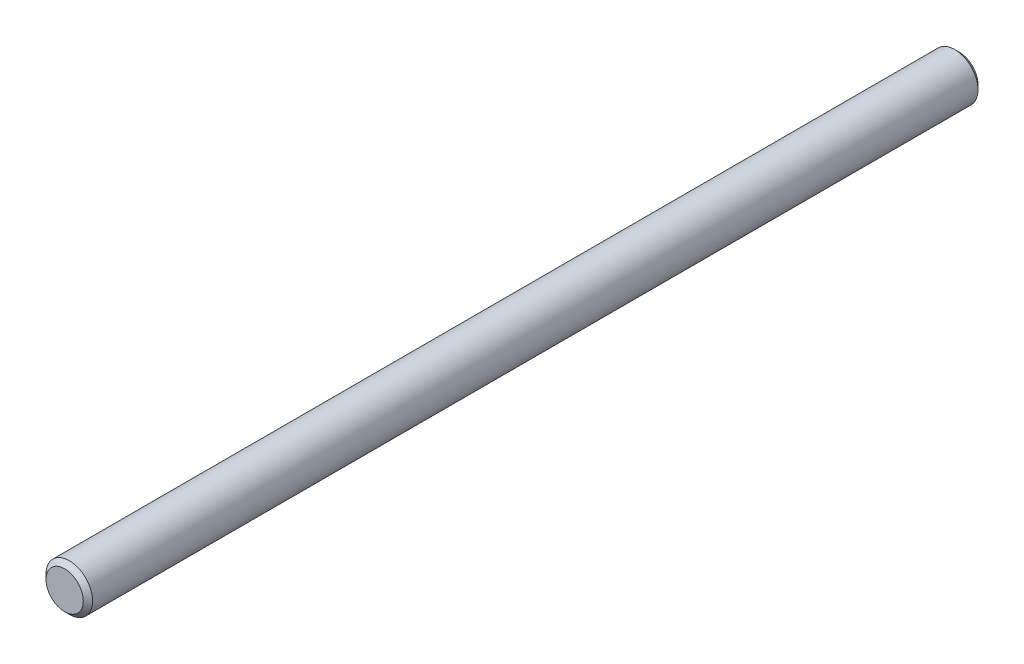
ISO-10303-21;
HEADER;
FILE_DESCRIPTION(('STEP AP214'),'2;1');
FILE_NAME('part.step','',(''),(''),'','','');
FILE_SCHEMA(('AUTOMOTIVE_DESIGN { 1 0 10303 214 1 1 1 1 }'));
ENDSEC;
DATA;
#1=APPLICATION_CONTEXT('core data for automotive mechanical design processes');
#2=APPLICATION_PROTOCOL_DEFINITION('international standard','automotive_design',2000,#1);
#3=PRODUCT_CONTEXT('',#1,'mechanical');
#4=PRODUCT('Part','Part','',(#3));
#5=PRODUCT_RELATED_PRODUCT_CATEGORY('part','',(#4));
#6=PRODUCT_DEFINITION_FORMATION('','',#4);
#7=PRODUCT_DEFINITION_CONTEXT('part definition',#1,'design');
#8=PRODUCT_DEFINITION('design','',#6,#7);
#9=PRODUCT_DEFINITION_SHAPE('','',#8);
#10=(LENGTH_UNIT() NAMED_UNIT(*) SI_UNIT(.MILLI.,.METRE.));
#11=(NAMED_UNIT(*) PLANE_ANGLE_UNIT() SI_UNIT($,.RADIAN.));
#12=(NAMED_UNIT(*) SI_UNIT($,.STERADIAN.) SOLID_ANGLE_UNIT());
#13=UNCERTAINTY_MEASURE_WITH_UNIT(LENGTH_MEASURE(1.E-05),#10,'distance_accuracy_value','');
#14=(GEOMETRIC_REPRESENTATION_CONTEXT(3) GLOBAL_UNCERTAINTY_ASSIGNED_CONTEXT((#13)) GLOBAL_UNIT_ASSIGNED_CONTEXT((#10,
#11,#12)) REPRESENTATION_CONTEXT('',''));
#15=CARTESIAN_POINT('',(0.,0.,0.));
#16=DIRECTION('',(0.,0.,1.));
#17=DIRECTION('',(1.,0.,0.));
#18=AXIS2_PLACEMENT_3D('',#15,#16,#17);
#19=CARTESIAN_POINT('',(0.,0.,76.2));
#20=DIRECTION('',(0.,0.,-1.));
#21=DIRECTION('',(-1.,0.,0.));
#22=AXIS2_PLACEMENT_3D('',#19,#20,#21);
#23=CYLINDRICAL_SURFACE('',#22,3.96875);
#24=CARTESIAN_POINT('',(0.,0.,-75.4062499999998));
#25=DIRECTION('',(0.,0.,1.));
#26=DIRECTION('',(1.,0.,0.));
#27=AXIS2_PLACEMENT_3D('',#24,#25,#26);
#28=CIRCLE('',#27,3.96875);
#29=CARTESIAN_POINT('',(3.96875,0.,-75.4062499999998));
#30=VERTEX_POINT('',#29);
#31=EDGE_CURVE('E48',#30,#30,#28,.T.);
#32=ORIENTED_EDGE('',*,*,#31,.T.);
#33=EDGE_LOOP('',(#32));
#34=FACE_BOUND('',#33,.T.);
#35=CARTESIAN_POINT('',(0.,0.,75.4062500000001));
#36=DIRECTION('',(0.,0.,1.));
#37=DIRECTION('',(1.,0.,0.));
#38=AXIS2_PLACEMENT_3D('',#35,#36,#37);
#39=CIRCLE('',#38,3.96875);
#40=CARTESIAN_POINT('',(3.96875,0.,75.4062500000001));
#41=VERTEX_POINT('',#40);
#42=EDGE_CURVE('E53',#41,#41,#39,.F.);
#43=ORIENTED_EDGE('',*,*,#42,.T.);
#44=EDGE_LOOP('',(#43));
#45=FACE_BOUND('',#44,.T.);
#46=ADVANCED_FACE('F34',(#34,#45),#23,.T.);
#47=CARTESIAN_POINT('',(0.,0.,76.2));
#48=DIRECTION('',(0.,0.,1.));
#49=DIRECTION('',(1.,0.,0.));
#50=AXIS2_PLACEMENT_3D('',#47,#48,#49);
#51=PLANE('',#50);
#52=CARTESIAN_POINT('',(0.,0.,76.2));
#53=DIRECTION('',(0.,0.,1.));
#54=DIRECTION('',(1.,0.,0.));
#55=AXIS2_PLACEMENT_3D('',#52,#53,#54);
#56=CIRCLE('',#55,3.17500000000007);
#57=CARTESIAN_POINT('',(3.17500000000007,0.,76.2));
#58=VERTEX_POINT('',#57);
#59=EDGE_CURVE('E10',#58,#58,#56,.T.);
#60=ORIENTED_EDGE('',*,*,#59,.T.);
#61=EDGE_LOOP('',(#60));
#62=FACE_BOUND('',#61,.T.);
#63=ADVANCED_FACE('F69',(#62),#51,.T.);
#64=CARTESIAN_POINT('',(0.,0.,-76.2));
#65=DIRECTION('',(0.,0.,1.));
#66=DIRECTION('',(1.,0.,0.));
#67=AXIS2_PLACEMENT_3D('',#64,#65,#66);
#68=PLANE('',#67);
#69=CARTESIAN_POINT('',(0.,0.,-76.2));
#70=DIRECTION('',(0.,0.,1.));
#71=DIRECTION('',(1.,0.,0.));
#72=AXIS2_PLACEMENT_3D('',#69,#70,#71);
#73=CIRCLE('',#72,3.17499999999982);
#74=CARTESIAN_POINT('',(3.17499999999982,0.,-76.2));
#75=VERTEX_POINT('',#74);
#76=EDGE_CURVE('E42',#75,#75,#73,.F.);
#77=ORIENTED_EDGE('',*,*,#76,.T.);
#78=EDGE_LOOP('',(#77));
#79=FACE_BOUND('',#78,.T.);
#80=ADVANCED_FACE('F66',(#79),#68,.F.);
#81=CARTESIAN_POINT('',(0.,0.,-75.4062499999998));
#82=DIRECTION('',(0.,0.,1.));
#83=DIRECTION('',(1.,0.,0.));
#84=AXIS2_PLACEMENT_3D('',#81,#82,#83);
#85=CONICAL_SURFACE('',#84,3.96875,0.785398163397453);
#86=ORIENTED_EDGE('',*,*,#76,.F.);
#87=EDGE_LOOP('',(#86));
#88=FACE_BOUND('',#87,.T.);
#89=ORIENTED_EDGE('',*,*,#31,.F.);
#90=EDGE_LOOP('',(#89));
#91=FACE_BOUND('',#90,.T.);
#92=ADVANCED_FACE('F62',(#88,#91),#85,.T.);
#93=CARTESIAN_POINT('',(0.,0.,76.2));
#94=DIRECTION('',(0.,0.,-1.));
#95=DIRECTION('',(-1.,0.,0.));
#96=AXIS2_PLACEMENT_3D('',#93,#94,#95);
#97=CONICAL_SURFACE('',#96,3.17500000000007,0.785398163397445);
#98=ORIENTED_EDGE('',*,*,#42,.F.);
#99=EDGE_LOOP('',(#98));
#100=FACE_BOUND('',#99,.T.);
#101=ORIENTED_EDGE('',*,*,#59,.F.);
#102=EDGE_LOOP('',(#101));
#103=FACE_BOUND('',#102,.T.);
#104=ADVANCED_FACE('F36',(#100,#103),#97,.T.);
#105=CLOSED_SHELL('',(#46,#63,#80,#92,#104));
#106=MANIFOLD_SOLID_BREP('B2',#105);
#107=ADVANCED_BREP_SHAPE_REPRESENTATION('',(#18,#106),#14);
#108=SHAPE_DEFINITION_REPRESENTATION(#9,#107);
ENDSEC;
END-ISO-10303-21;
